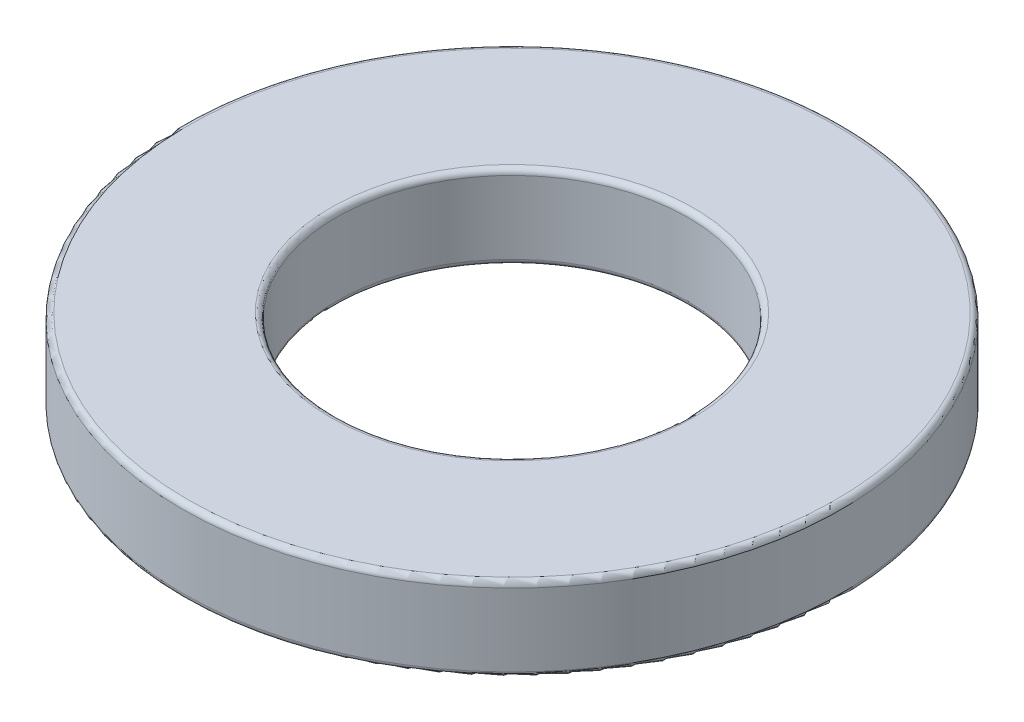
ISO-10303-21;
HEADER;
FILE_DESCRIPTION(('STEP AP214'),'2;1');
FILE_NAME('part.step','',(''),(''),'','','');
FILE_SCHEMA(('AUTOMOTIVE_DESIGN { 1 0 10303 214 1 1 1 1 }'));
ENDSEC;
DATA;
#1=APPLICATION_CONTEXT('core data for automotive mechanical design processes');
#2=APPLICATION_PROTOCOL_DEFINITION('international standard','automotive_design',2000,#1);
#3=PRODUCT_CONTEXT('',#1,'mechanical');
#4=PRODUCT('Part','Part','',(#3));
#5=PRODUCT_RELATED_PRODUCT_CATEGORY('part','',(#4));
#6=PRODUCT_DEFINITION_FORMATION('','',#4);
#7=PRODUCT_DEFINITION_CONTEXT('part definition',#1,'design');
#8=PRODUCT_DEFINITION('design','',#6,#7);
#9=PRODUCT_DEFINITION_SHAPE('','',#8);
#10=(LENGTH_UNIT() NAMED_UNIT(*) SI_UNIT(.MILLI.,.METRE.));
#11=(NAMED_UNIT(*) PLANE_ANGLE_UNIT() SI_UNIT($,.RADIAN.));
#12=(NAMED_UNIT(*) SI_UNIT($,.STERADIAN.) SOLID_ANGLE_UNIT());
#13=UNCERTAINTY_MEASURE_WITH_UNIT(LENGTH_MEASURE(1.E-05),#10,'distance_accuracy_value','');
#14=(GEOMETRIC_REPRESENTATION_CONTEXT(3) GLOBAL_UNCERTAINTY_ASSIGNED_CONTEXT((#13)) GLOBAL_UNIT_ASSIGNED_CONTEXT((#10,
#11,#12)) REPRESENTATION_CONTEXT('',''));
#15=CARTESIAN_POINT('',(0.,0.,0.));
#16=DIRECTION('',(0.,0.,1.));
#17=DIRECTION('',(1.,0.,0.));
#18=AXIS2_PLACEMENT_3D('',#15,#16,#17);
#19=CARTESIAN_POINT('',(0.,1.5,0.));
#20=DIRECTION('',(0.,1.,0.));
#21=DIRECTION('',(0.,0.,1.));
#22=AXIS2_PLACEMENT_3D('',#19,#20,#21);
#23=PLANE('',#22);
#24=CARTESIAN_POINT('',(0.,1.5,0.));
#25=DIRECTION('',(0.,1.,0.));
#26=DIRECTION('',(0.,0.,1.));
#27=AXIS2_PLACEMENT_3D('',#24,#25,#26);
#28=CIRCLE('',#27,3.25);
#29=CARTESIAN_POINT('',(0.,1.5,3.25));
#30=VERTEX_POINT('',#29);
#31=EDGE_CURVE('E53',#30,#30,#28,.F.);
#32=ORIENTED_EDGE('',*,*,#31,.T.);
#33=EDGE_LOOP('',(#32));
#34=FACE_BOUND('',#33,.T.);
#35=CARTESIAN_POINT('',(0.,1.5,0.));
#36=DIRECTION('',(0.,1.,0.));
#37=DIRECTION('',(0.,0.,1.));
#38=AXIS2_PLACEMENT_3D('',#35,#36,#37);
#39=CIRCLE('',#38,5.8);
#40=CARTESIAN_POINT('',(0.,1.5,5.8));
#41=VERTEX_POINT('',#40);
#42=EDGE_CURVE('E56',#41,#41,#39,.T.);
#43=ORIENTED_EDGE('',*,*,#42,.T.);
#44=EDGE_LOOP('',(#43));
#45=FACE_BOUND('',#44,.T.);
#46=ADVANCED_FACE('F33',(#34,#45),#23,.T.);
#47=CARTESIAN_POINT('',(0.,0.,0.));
#48=DIRECTION('',(0.,1.,0.));
#49=DIRECTION('',(0.,0.,1.));
#50=AXIS2_PLACEMENT_3D('',#47,#48,#49);
#51=PLANE('',#50);
#52=CARTESIAN_POINT('',(0.,0.,0.));
#53=DIRECTION('',(0.,1.,0.));
#54=DIRECTION('',(0.,0.,1.));
#55=AXIS2_PLACEMENT_3D('',#52,#53,#54);
#56=CIRCLE('',#55,3.25);
#57=CARTESIAN_POINT('',(0.,0.,3.25));
#58=VERTEX_POINT('',#57);
#59=EDGE_CURVE('E44',#58,#58,#56,.T.);
#60=ORIENTED_EDGE('',*,*,#59,.T.);
#61=EDGE_LOOP('',(#60));
#62=FACE_BOUND('',#61,.T.);
#63=CARTESIAN_POINT('',(0.,0.,0.));
#64=DIRECTION('',(0.,1.,0.));
#65=DIRECTION('',(0.,0.,1.));
#66=AXIS2_PLACEMENT_3D('',#63,#64,#65);
#67=CIRCLE('',#66,5.8);
#68=CARTESIAN_POINT('',(0.,0.,5.8));
#69=VERTEX_POINT('',#68);
#70=EDGE_CURVE('E48',#69,#69,#67,.F.);
#71=ORIENTED_EDGE('',*,*,#70,.T.);
#72=EDGE_LOOP('',(#71));
#73=FACE_BOUND('',#72,.T.);
#74=ADVANCED_FACE('F76',(#62,#73),#51,.F.);
#75=CARTESIAN_POINT('',(0.,1.5,0.));
#76=DIRECTION('',(0.,-1.,0.));
#77=DIRECTION('',(0.,0.,-1.));
#78=AXIS2_PLACEMENT_3D('',#75,#76,#77);
#79=CYLINDRICAL_SURFACE('',#78,5.9);
#80=CARTESIAN_POINT('',(0.,0.1,0.));
#81=DIRECTION('',(0.,1.,0.));
#82=DIRECTION('',(0.,0.,1.));
#83=AXIS2_PLACEMENT_3D('',#80,#81,#82);
#84=CIRCLE('',#83,5.9);
#85=CARTESIAN_POINT('',(0.,0.1,5.9));
#86=VERTEX_POINT('',#85);
#87=EDGE_CURVE('E10',#86,#86,#84,.T.);
#88=ORIENTED_EDGE('',*,*,#87,.T.);
#89=EDGE_LOOP('',(#88));
#90=FACE_BOUND('',#89,.T.);
#91=CARTESIAN_POINT('',(0.,1.4,0.));
#92=DIRECTION('',(0.,1.,0.));
#93=DIRECTION('',(0.,0.,1.));
#94=AXIS2_PLACEMENT_3D('',#91,#92,#93);
#95=CIRCLE('',#94,5.9);
#96=CARTESIAN_POINT('',(0.,1.4,5.9));
#97=VERTEX_POINT('',#96);
#98=EDGE_CURVE('E40',#97,#97,#95,.F.);
#99=ORIENTED_EDGE('',*,*,#98,.T.);
#100=EDGE_LOOP('',(#99));
#101=FACE_BOUND('',#100,.T.);
#102=ADVANCED_FACE('F79',(#90,#101),#79,.T.);
#103=CARTESIAN_POINT('',(0.,1.5,0.));
#104=DIRECTION('',(0.,-1.,0.));
#105=DIRECTION('',(0.,0.,-1.));
#106=AXIS2_PLACEMENT_3D('',#103,#104,#105);
#107=CYLINDRICAL_SURFACE('',#106,3.15);
#108=CARTESIAN_POINT('',(0.,1.4,0.));
#109=DIRECTION('',(0.,1.,0.));
#110=DIRECTION('',(0.,0.,1.));
#111=AXIS2_PLACEMENT_3D('',#108,#109,#110);
#112=CIRCLE('',#111,3.15);
#113=CARTESIAN_POINT('',(0.,1.4,3.15));
#114=VERTEX_POINT('',#113);
#115=EDGE_CURVE('E59',#114,#114,#112,.T.);
#116=ORIENTED_EDGE('',*,*,#115,.T.);
#117=EDGE_LOOP('',(#116));
#118=FACE_BOUND('',#117,.T.);
#119=CARTESIAN_POINT('',(0.,0.1,0.));
#120=DIRECTION('',(0.,1.,0.));
#121=DIRECTION('',(0.,0.,1.));
#122=AXIS2_PLACEMENT_3D('',#119,#120,#121);
#123=CIRCLE('',#122,3.15);
#124=CARTESIAN_POINT('',(0.,0.1,3.15));
#125=VERTEX_POINT('',#124);
#126=EDGE_CURVE('E62',#125,#125,#123,.F.);
#127=ORIENTED_EDGE('',*,*,#126,.T.);
#128=EDGE_LOOP('',(#127));
#129=FACE_BOUND('',#128,.T.);
#130=ADVANCED_FACE('F66',(#118,#129),#107,.F.);
#131=CARTESIAN_POINT('',(0.,1.4,0.));
#132=DIRECTION('',(0.,1.,0.));
#133=DIRECTION('',(0.,0.,1.));
#134=AXIS2_PLACEMENT_3D('',#131,#132,#133);
#135=TOROIDAL_SURFACE('',#134,3.25,0.1);
#136=ORIENTED_EDGE('',*,*,#31,.F.);
#137=EDGE_LOOP('',(#136));
#138=FACE_BOUND('',#137,.T.);
#139=ORIENTED_EDGE('',*,*,#115,.F.);
#140=EDGE_LOOP('',(#139));
#141=FACE_BOUND('',#140,.T.);
#142=ADVANCED_FACE('F72',(#138,#141),#135,.T.);
#143=CARTESIAN_POINT('',(0.,0.1,0.));
#144=DIRECTION('',(0.,1.,0.));
#145=DIRECTION('',(0.,0.,1.));
#146=AXIS2_PLACEMENT_3D('',#143,#144,#145);
#147=TOROIDAL_SURFACE('',#146,3.25,0.1);
#148=ORIENTED_EDGE('',*,*,#126,.F.);
#149=EDGE_LOOP('',(#148));
#150=FACE_BOUND('',#149,.T.);
#151=ORIENTED_EDGE('',*,*,#59,.F.);
#152=EDGE_LOOP('',(#151));
#153=FACE_BOUND('',#152,.T.);
#154=ADVANCED_FACE('F68',(#150,#153),#147,.T.);
#155=CARTESIAN_POINT('',(0.,0.1,0.));
#156=DIRECTION('',(0.,1.,0.));
#157=DIRECTION('',(0.,0.,1.));
#158=AXIS2_PLACEMENT_3D('',#155,#156,#157);
#159=TOROIDAL_SURFACE('',#158,5.8,0.1);
#160=ORIENTED_EDGE('',*,*,#70,.F.);
#161=EDGE_LOOP('',(#160));
#162=FACE_BOUND('',#161,.T.);
#163=ORIENTED_EDGE('',*,*,#87,.F.);
#164=EDGE_LOOP('',(#163));
#165=FACE_BOUND('',#164,.T.);
#166=ADVANCED_FACE('F71',(#162,#165),#159,.T.);
#167=CARTESIAN_POINT('',(0.,1.4,0.));
#168=DIRECTION('',(0.,1.,0.));
#169=DIRECTION('',(0.,0.,1.));
#170=AXIS2_PLACEMENT_3D('',#167,#168,#169);
#171=TOROIDAL_SURFACE('',#170,5.8,0.1);
#172=ORIENTED_EDGE('',*,*,#98,.F.);
#173=EDGE_LOOP('',(#172));
#174=FACE_BOUND('',#173,.T.);
#175=ORIENTED_EDGE('',*,*,#42,.F.);
#176=EDGE_LOOP('',(#175));
#177=FACE_BOUND('',#176,.T.);
#178=ADVANCED_FACE('F35',(#174,#177),#171,.T.);
#179=CLOSED_SHELL('',(#46,#74,#102,#130,#142,#154,#166,#178));
#180=MANIFOLD_SOLID_BREP('B2',#179);
#181=ADVANCED_BREP_SHAPE_REPRESENTATION('',(#18,#180),#14);
#182=SHAPE_DEFINITION_REPRESENTATION(#9,#181);
ENDSEC;
END-ISO-10303-21;
